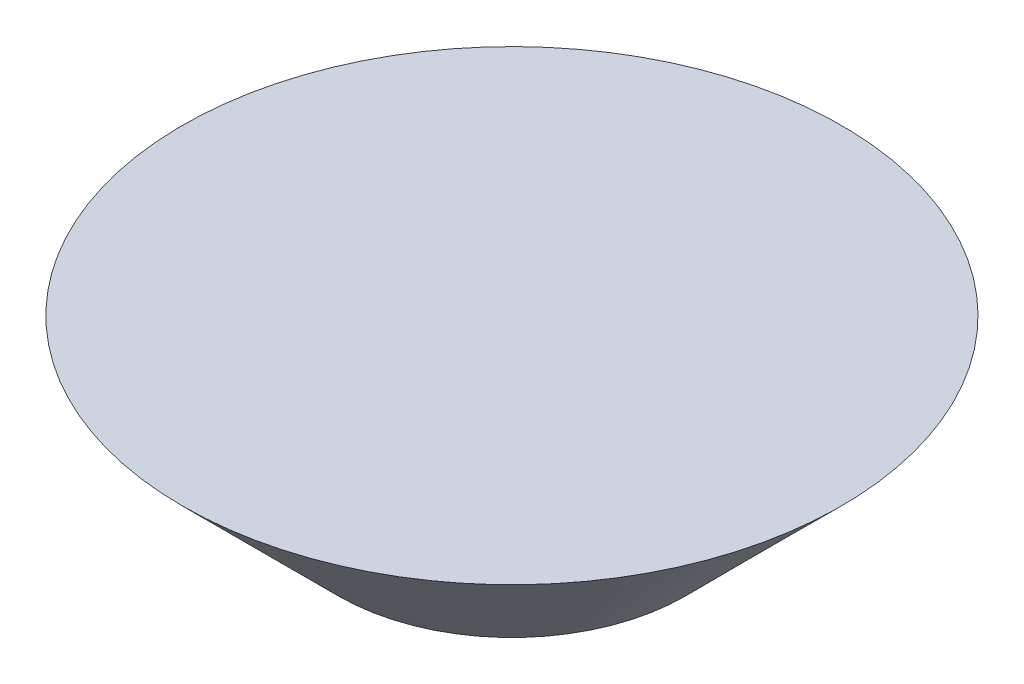
ISO-10303-21;
HEADER;
FILE_DESCRIPTION(('STEP AP214'),'2;1');
FILE_NAME('part.step','',(''),(''),'','','');
FILE_SCHEMA(('AUTOMOTIVE_DESIGN { 1 0 10303 214 1 1 1 1 }'));
ENDSEC;
DATA;
#1=APPLICATION_CONTEXT('core data for automotive mechanical design processes');
#2=APPLICATION_PROTOCOL_DEFINITION('international standard','automotive_design',2000,#1);
#3=PRODUCT_CONTEXT('',#1,'mechanical');
#4=PRODUCT('Part','Part','',(#3));
#5=PRODUCT_RELATED_PRODUCT_CATEGORY('part','',(#4));
#6=PRODUCT_DEFINITION_FORMATION('','',#4);
#7=PRODUCT_DEFINITION_CONTEXT('part definition',#1,'design');
#8=PRODUCT_DEFINITION('design','',#6,#7);
#9=PRODUCT_DEFINITION_SHAPE('','',#8);
#10=(LENGTH_UNIT() NAMED_UNIT(*) SI_UNIT(.MILLI.,.METRE.));
#11=(NAMED_UNIT(*) PLANE_ANGLE_UNIT() SI_UNIT($,.RADIAN.));
#12=(NAMED_UNIT(*) SI_UNIT($,.STERADIAN.) SOLID_ANGLE_UNIT());
#13=UNCERTAINTY_MEASURE_WITH_UNIT(LENGTH_MEASURE(1.E-05),#10,'distance_accuracy_value','');
#14=(GEOMETRIC_REPRESENTATION_CONTEXT(3) GLOBAL_UNCERTAINTY_ASSIGNED_CONTEXT((#13)) GLOBAL_UNIT_ASSIGNED_CONTEXT((#10,
#11,#12)) REPRESENTATION_CONTEXT('',''));
#15=CARTESIAN_POINT('',(0.,0.,0.));
#16=DIRECTION('',(0.,0.,1.));
#17=DIRECTION('',(1.,0.,0.));
#18=AXIS2_PLACEMENT_3D('',#15,#16,#17);
#19=CARTESIAN_POINT('',(0.,36.,0.));
#20=DIRECTION('',(0.,1.,0.));
#21=DIRECTION('',(0.,0.,1.));
#22=AXIS2_PLACEMENT_3D('',#19,#20,#21);
#23=PLANE('',#22);
#24=CARTESIAN_POINT('',(0.,36.,0.));
#25=DIRECTION('',(0.,1.,0.));
#26=DIRECTION('',(0.,0.,1.));
#27=AXIS2_PLACEMENT_3D('',#24,#25,#26);
#28=CIRCLE('',#27,76.);
#29=CARTESIAN_POINT('',(0.,36.,76.));
#30=VERTEX_POINT('',#29);
#31=EDGE_CURVE('E38',#30,#30,#28,.T.);
#32=ORIENTED_EDGE('',*,*,#31,.T.);
#33=EDGE_LOOP('',(#32));
#34=FACE_BOUND('',#33,.T.);
#35=ADVANCED_FACE('F31',(#34),#23,.T.);
#36=CARTESIAN_POINT('',(0.,0.,0.));
#37=DIRECTION('',(0.,1.,0.));
#38=DIRECTION('',(0.,0.,1.));
#39=AXIS2_PLACEMENT_3D('',#36,#37,#38);
#40=PLANE('',#39);
#41=CARTESIAN_POINT('',(0.,0.,0.));
#42=DIRECTION('',(0.,1.,0.));
#43=DIRECTION('',(0.,0.,1.));
#44=AXIS2_PLACEMENT_3D('',#41,#42,#43);
#45=CIRCLE('',#44,39.9999999999998);
#46=CARTESIAN_POINT('',(0.,0.,39.9999999999998));
#47=VERTEX_POINT('',#46);
#48=EDGE_CURVE('E10',#47,#47,#45,.F.);
#49=ORIENTED_EDGE('',*,*,#48,.T.);
#50=EDGE_LOOP('',(#49));
#51=FACE_BOUND('',#50,.T.);
#52=ADVANCED_FACE('F46',(#51),#40,.F.);
#53=CARTESIAN_POINT('',(0.,36.,0.));
#54=DIRECTION('',(0.,1.,0.));
#55=DIRECTION('',(0.,0.,1.));
#56=AXIS2_PLACEMENT_3D('',#53,#54,#55);
#57=CONICAL_SURFACE('',#56,76.,0.78539816339745);
#58=ORIENTED_EDGE('',*,*,#48,.F.);
#59=EDGE_LOOP('',(#58));
#60=FACE_BOUND('',#59,.T.);
#61=ORIENTED_EDGE('',*,*,#31,.F.);
#62=EDGE_LOOP('',(#61));
#63=FACE_BOUND('',#62,.T.);
#64=ADVANCED_FACE('F33',(#60,#63),#57,.T.);
#65=CLOSED_SHELL('',(#35,#52,#64));
#66=MANIFOLD_SOLID_BREP('B2',#65);
#67=ADVANCED_BREP_SHAPE_REPRESENTATION('',(#18,#66),#14);
#68=SHAPE_DEFINITION_REPRESENTATION(#9,#67);
ENDSEC;
END-ISO-10303-21;
